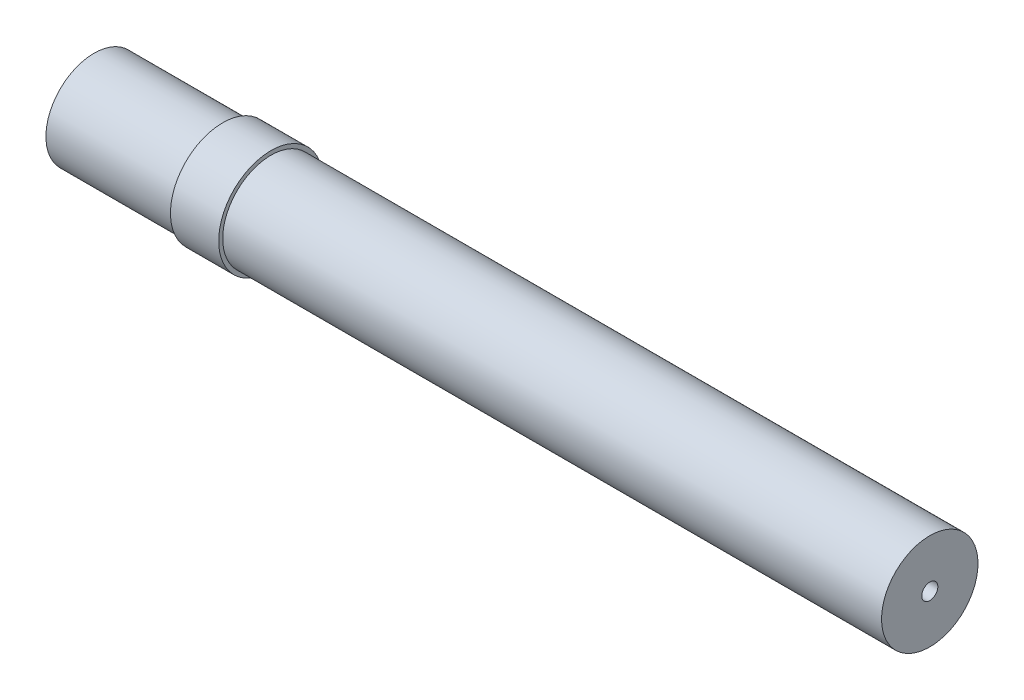
ISO-10303-21;
HEADER;
FILE_DESCRIPTION(('STEP AP214'),'2;1');
FILE_NAME('part.step','',(''),(''),'','','');
FILE_SCHEMA(('AUTOMOTIVE_DESIGN { 1 0 10303 214 1 1 1 1 }'));
ENDSEC;
DATA;
#1=APPLICATION_CONTEXT('core data for automotive mechanical design processes');
#2=APPLICATION_PROTOCOL_DEFINITION('international standard','automotive_design',2000,#1);
#3=PRODUCT_CONTEXT('',#1,'mechanical');
#4=PRODUCT('Part','Part','',(#3));
#5=PRODUCT_RELATED_PRODUCT_CATEGORY('part','',(#4));
#6=PRODUCT_DEFINITION_FORMATION('','',#4);
#7=PRODUCT_DEFINITION_CONTEXT('part definition',#1,'design');
#8=PRODUCT_DEFINITION('design','',#6,#7);
#9=PRODUCT_DEFINITION_SHAPE('','',#8);
#10=(LENGTH_UNIT() NAMED_UNIT(*) SI_UNIT(.MILLI.,.METRE.));
#11=(NAMED_UNIT(*) PLANE_ANGLE_UNIT() SI_UNIT($,.RADIAN.));
#12=(NAMED_UNIT(*) SI_UNIT($,.STERADIAN.) SOLID_ANGLE_UNIT());
#13=UNCERTAINTY_MEASURE_WITH_UNIT(LENGTH_MEASURE(1.E-05),#10,'distance_accuracy_value','');
#14=(GEOMETRIC_REPRESENTATION_CONTEXT(3) GLOBAL_UNCERTAINTY_ASSIGNED_CONTEXT((#13)) GLOBAL_UNIT_ASSIGNED_CONTEXT((#10,
#11,#12)) REPRESENTATION_CONTEXT('',''));
#15=CARTESIAN_POINT('',(0.,0.,0.));
#16=DIRECTION('',(0.,0.,1.));
#17=DIRECTION('',(1.,0.,0.));
#18=AXIS2_PLACEMENT_3D('',#15,#16,#17);
#19=CARTESIAN_POINT('',(13.5,0.,0.));
#20=DIRECTION('',(1.,0.,0.));
#21=DIRECTION('',(0.,0.,-1.));
#22=AXIS2_PLACEMENT_3D('',#19,#20,#21);
#23=CYLINDRICAL_SURFACE('',#22,3.25);
#24=CARTESIAN_POINT('',(-33.,0.,0.));
#25=DIRECTION('',(1.,0.,0.));
#26=DIRECTION('',(0.,0.,-1.));
#27=AXIS2_PLACEMENT_3D('',#24,#25,#26);
#28=CIRCLE('',#27,3.24999999999999);
#29=CARTESIAN_POINT('',(-33.,0.,-3.24999999999999));
#30=VERTEX_POINT('',#29);
#31=EDGE_CURVE('E10',#30,#30,#28,.T.);
#32=ORIENTED_EDGE('',*,*,#31,.T.);
#33=EDGE_LOOP('',(#32));
#34=FACE_BOUND('',#33,.T.);
#35=CARTESIAN_POINT('',(-30.,0.,0.));
#36=DIRECTION('',(1.,0.,0.));
#37=DIRECTION('',(0.,0.,-1.));
#38=AXIS2_PLACEMENT_3D('',#35,#36,#37);
#39=CIRCLE('',#38,3.25);
#40=CARTESIAN_POINT('',(-30.,0.,-3.25));
#41=VERTEX_POINT('',#40);
#42=EDGE_CURVE('E81',#41,#41,#39,.T.);
#43=ORIENTED_EDGE('',*,*,#42,.F.);
#44=EDGE_LOOP('',(#43));
#45=FACE_BOUND('',#44,.T.);
#46=ADVANCED_FACE('F38',(#34,#45),#23,.T.);
#47=CARTESIAN_POINT('',(-33.,3.24999999999999,0.));
#48=DIRECTION('',(-1.,0.,0.));
#49=DIRECTION('',(0.,0.,1.));
#50=AXIS2_PLACEMENT_3D('',#47,#48,#49);
#51=PLANE('',#50);
#52=CARTESIAN_POINT('',(-33.,0.,0.));
#53=DIRECTION('',(1.,0.,0.));
#54=DIRECTION('',(0.,0.,-1.));
#55=AXIS2_PLACEMENT_3D('',#52,#53,#54);
#56=CIRCLE('',#55,2.99999999999999);
#57=CARTESIAN_POINT('',(-33.,0.,-2.99999999999999));
#58=VERTEX_POINT('',#57);
#59=EDGE_CURVE('E45',#58,#58,#56,.T.);
#60=ORIENTED_EDGE('',*,*,#59,.T.);
#61=EDGE_LOOP('',(#60));
#62=FACE_BOUND('',#61,.T.);
#63=ORIENTED_EDGE('',*,*,#31,.F.);
#64=EDGE_LOOP('',(#63));
#65=FACE_BOUND('',#64,.T.);
#66=ADVANCED_FACE('F90',(#62,#65),#51,.T.);
#67=CARTESIAN_POINT('',(13.5,0.,0.));
#68=DIRECTION('',(1.,0.,0.));
#69=DIRECTION('',(0.,0.,-1.));
#70=AXIS2_PLACEMENT_3D('',#67,#68,#69);
#71=CYLINDRICAL_SURFACE('',#70,2.99999999999999);
#72=CARTESIAN_POINT('',(-41.,0.,0.));
#73=DIRECTION('',(1.,0.,0.));
#74=DIRECTION('',(0.,0.,-1.));
#75=AXIS2_PLACEMENT_3D('',#72,#73,#74);
#76=CIRCLE('',#75,2.99999999999999);
#77=CARTESIAN_POINT('',(-41.,0.,-2.99999999999999));
#78=VERTEX_POINT('',#77);
#79=EDGE_CURVE('E50',#78,#78,#76,.T.);
#80=ORIENTED_EDGE('',*,*,#79,.T.);
#81=EDGE_LOOP('',(#80));
#82=FACE_BOUND('',#81,.T.);
#83=ORIENTED_EDGE('',*,*,#59,.F.);
#84=EDGE_LOOP('',(#83));
#85=FACE_BOUND('',#84,.T.);
#86=ADVANCED_FACE('F94',(#82,#85),#71,.T.);
#87=CARTESIAN_POINT('',(-41.,2.99999999999999,0.));
#88=DIRECTION('',(-1.,0.,0.));
#89=DIRECTION('',(0.,0.,1.));
#90=AXIS2_PLACEMENT_3D('',#87,#88,#89);
#91=PLANE('',#90);
#92=CARTESIAN_POINT('',(-41.,0.,0.));
#93=DIRECTION('',(1.,0.,0.));
#94=DIRECTION('',(0.,0.,-1.));
#95=AXIS2_PLACEMENT_3D('',#92,#93,#94);
#96=CIRCLE('',#95,2.24999999999999);
#97=CARTESIAN_POINT('',(-41.,0.,-2.24999999999999));
#98=VERTEX_POINT('',#97);
#99=EDGE_CURVE('E55',#98,#98,#96,.T.);
#100=ORIENTED_EDGE('',*,*,#99,.T.);
#101=EDGE_LOOP('',(#100));
#102=FACE_BOUND('',#101,.T.);
#103=ORIENTED_EDGE('',*,*,#79,.F.);
#104=EDGE_LOOP('',(#103));
#105=FACE_BOUND('',#104,.T.);
#106=ADVANCED_FACE('F98',(#102,#105),#91,.T.);
#107=CARTESIAN_POINT('',(13.5,0.,0.));
#108=DIRECTION('',(1.,0.,0.));
#109=DIRECTION('',(0.,0.,-1.));
#110=AXIS2_PLACEMENT_3D('',#107,#108,#109);
#111=CYLINDRICAL_SURFACE('',#110,2.25);
#112=CARTESIAN_POINT('',(10.,0.,0.));
#113=DIRECTION('',(1.,0.,0.));
#114=DIRECTION('',(0.,0.,-1.));
#115=AXIS2_PLACEMENT_3D('',#112,#113,#114);
#116=CIRCLE('',#115,2.25);
#117=CARTESIAN_POINT('',(10.,0.,-2.25));
#118=VERTEX_POINT('',#117);
#119=EDGE_CURVE('E61',#118,#118,#116,.T.);
#120=ORIENTED_EDGE('',*,*,#119,.T.);
#121=EDGE_LOOP('',(#120));
#122=FACE_BOUND('',#121,.T.);
#123=ORIENTED_EDGE('',*,*,#99,.F.);
#124=EDGE_LOOP('',(#123));
#125=FACE_BOUND('',#124,.T.);
#126=ADVANCED_FACE('F105',(#122,#125),#111,.F.);
#127=CARTESIAN_POINT('',(10.,0.499999999999998,0.));
#128=DIRECTION('',(-1.,0.,0.));
#129=DIRECTION('',(0.,0.,1.));
#130=AXIS2_PLACEMENT_3D('',#127,#128,#129);
#131=PLANE('',#130);
#132=CARTESIAN_POINT('',(10.,0.,0.));
#133=DIRECTION('',(1.,0.,0.));
#134=DIRECTION('',(0.,0.,-1.));
#135=AXIS2_PLACEMENT_3D('',#132,#133,#134);
#136=CIRCLE('',#135,0.499999999999998);
#137=CARTESIAN_POINT('',(10.,0.,-0.499999999999998));
#138=VERTEX_POINT('',#137);
#139=EDGE_CURVE('E65',#138,#138,#136,.T.);
#140=ORIENTED_EDGE('',*,*,#139,.T.);
#141=EDGE_LOOP('',(#140));
#142=FACE_BOUND('',#141,.T.);
#143=ORIENTED_EDGE('',*,*,#119,.F.);
#144=EDGE_LOOP('',(#143));
#145=FACE_BOUND('',#144,.T.);
#146=ADVANCED_FACE('F109',(#142,#145),#131,.T.);
#147=CARTESIAN_POINT('',(13.5,0.,0.));
#148=DIRECTION('',(1.,0.,0.));
#149=DIRECTION('',(0.,0.,-1.));
#150=AXIS2_PLACEMENT_3D('',#147,#148,#149);
#151=CYLINDRICAL_SURFACE('',#150,0.499999999999998);
#152=CARTESIAN_POINT('',(11.,0.,0.));
#153=DIRECTION('',(1.,0.,0.));
#154=DIRECTION('',(0.,0.,-1.));
#155=AXIS2_PLACEMENT_3D('',#152,#153,#154);
#156=CIRCLE('',#155,0.499999999999998);
#157=CARTESIAN_POINT('',(11.,0.,-0.499999999999998));
#158=VERTEX_POINT('',#157);
#159=EDGE_CURVE('E69',#158,#158,#156,.T.);
#160=ORIENTED_EDGE('',*,*,#159,.T.);
#161=EDGE_LOOP('',(#160));
#162=FACE_BOUND('',#161,.T.);
#163=ORIENTED_EDGE('',*,*,#139,.F.);
#164=EDGE_LOOP('',(#163));
#165=FACE_BOUND('',#164,.T.);
#166=ADVANCED_FACE('F113',(#162,#165),#151,.F.);
#167=CARTESIAN_POINT('',(11.,2.99999999999999,0.));
#168=DIRECTION('',(1.,0.,0.));
#169=DIRECTION('',(0.,0.,-1.));
#170=AXIS2_PLACEMENT_3D('',#167,#168,#169);
#171=PLANE('',#170);
#172=CARTESIAN_POINT('',(11.,0.,0.));
#173=DIRECTION('',(1.,0.,0.));
#174=DIRECTION('',(0.,0.,-1.));
#175=AXIS2_PLACEMENT_3D('',#172,#173,#174);
#176=CIRCLE('',#175,2.99999999999999);
#177=CARTESIAN_POINT('',(11.,0.,-2.99999999999999));
#178=VERTEX_POINT('',#177);
#179=EDGE_CURVE('E73',#178,#178,#176,.T.);
#180=ORIENTED_EDGE('',*,*,#179,.T.);
#181=EDGE_LOOP('',(#180));
#182=FACE_BOUND('',#181,.T.);
#183=ORIENTED_EDGE('',*,*,#159,.F.);
#184=EDGE_LOOP('',(#183));
#185=FACE_BOUND('',#184,.T.);
#186=ADVANCED_FACE('F117',(#182,#185),#171,.T.);
#187=CARTESIAN_POINT('',(13.5,0.,0.));
#188=DIRECTION('',(1.,0.,0.));
#189=DIRECTION('',(0.,0.,-1.));
#190=AXIS2_PLACEMENT_3D('',#187,#188,#189);
#191=CYLINDRICAL_SURFACE('',#190,2.99999999999999);
#192=CARTESIAN_POINT('',(-30.,0.,0.));
#193=DIRECTION('',(1.,0.,0.));
#194=DIRECTION('',(0.,0.,-1.));
#195=AXIS2_PLACEMENT_3D('',#192,#193,#194);
#196=CIRCLE('',#195,2.99999999999999);
#197=CARTESIAN_POINT('',(-30.,0.,-2.99999999999999));
#198=VERTEX_POINT('',#197);
#199=EDGE_CURVE('E77',#198,#198,#196,.T.);
#200=ORIENTED_EDGE('',*,*,#199,.T.);
#201=EDGE_LOOP('',(#200));
#202=FACE_BOUND('',#201,.T.);
#203=ORIENTED_EDGE('',*,*,#179,.F.);
#204=EDGE_LOOP('',(#203));
#205=FACE_BOUND('',#204,.T.);
#206=ADVANCED_FACE('F121',(#202,#205),#191,.T.);
#207=CARTESIAN_POINT('',(-30.,3.25,0.));
#208=DIRECTION('',(1.,0.,0.));
#209=DIRECTION('',(0.,0.,-1.));
#210=AXIS2_PLACEMENT_3D('',#207,#208,#209);
#211=PLANE('',#210);
#212=ORIENTED_EDGE('',*,*,#42,.T.);
#213=EDGE_LOOP('',(#212));
#214=FACE_BOUND('',#213,.T.);
#215=ORIENTED_EDGE('',*,*,#199,.F.);
#216=EDGE_LOOP('',(#215));
#217=FACE_BOUND('',#216,.T.);
#218=ADVANCED_FACE('F86',(#214,#217),#211,.T.);
#219=CLOSED_SHELL('',(#46,#66,#86,#106,#126,#146,#166,#186,#206,#218));
#220=MANIFOLD_SOLID_BREP('B2',#219);
#221=ADVANCED_BREP_SHAPE_REPRESENTATION('',(#18,#220),#14);
#222=SHAPE_DEFINITION_REPRESENTATION(#9,#221);
ENDSEC;
END-ISO-10303-21;
